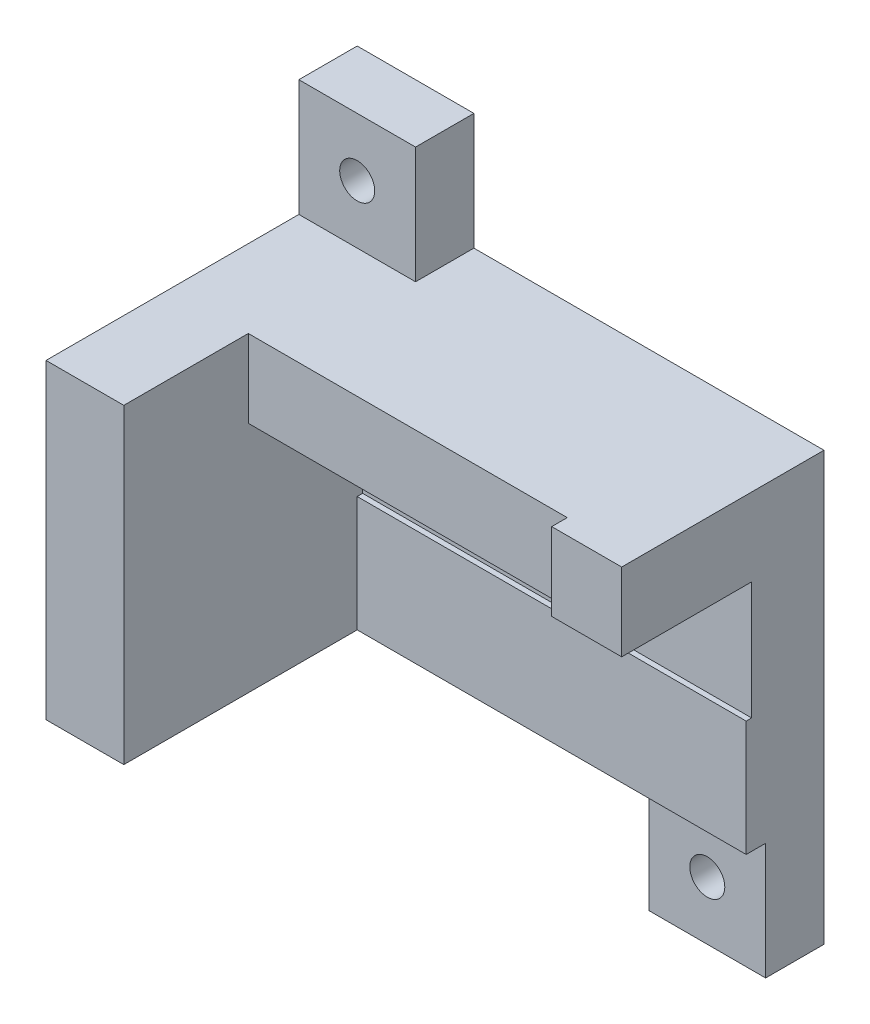
ISO-10303-21;
HEADER;
FILE_DESCRIPTION(('STEP AP214'),'2;1');
FILE_NAME('part.step','',(''),(''),'','','');
FILE_SCHEMA(('AUTOMOTIVE_DESIGN { 1 0 10303 214 1 1 1 1 }'));
ENDSEC;
DATA;
#1=APPLICATION_CONTEXT('core data for automotive mechanical design processes');
#2=APPLICATION_PROTOCOL_DEFINITION('international standard','automotive_design',2000,#1);
#3=PRODUCT_CONTEXT('',#1,'mechanical');
#4=PRODUCT('Part','Part','',(#3));
#5=PRODUCT_RELATED_PRODUCT_CATEGORY('part','',(#4));
#6=PRODUCT_DEFINITION_FORMATION('','',#4);
#7=PRODUCT_DEFINITION_CONTEXT('part definition',#1,'design');
#8=PRODUCT_DEFINITION('design','',#6,#7);
#9=PRODUCT_DEFINITION_SHAPE('','',#8);
#10=(LENGTH_UNIT() NAMED_UNIT(*) SI_UNIT(.MILLI.,.METRE.));
#11=(NAMED_UNIT(*) PLANE_ANGLE_UNIT() SI_UNIT($,.RADIAN.));
#12=(NAMED_UNIT(*) SI_UNIT($,.STERADIAN.) SOLID_ANGLE_UNIT());
#13=UNCERTAINTY_MEASURE_WITH_UNIT(LENGTH_MEASURE(1.E-05),#10,'distance_accuracy_value','');
#14=(GEOMETRIC_REPRESENTATION_CONTEXT(3) GLOBAL_UNCERTAINTY_ASSIGNED_CONTEXT((#13)) GLOBAL_UNIT_ASSIGNED_CONTEXT((#10,
#11,#12)) REPRESENTATION_CONTEXT('',''));
#15=CARTESIAN_POINT('',(0.,0.,0.));
#16=DIRECTION('',(0.,0.,1.));
#17=DIRECTION('',(1.,0.,0.));
#18=AXIS2_PLACEMENT_3D('',#15,#16,#17);
#19=CARTESIAN_POINT('',(0.,40.,40.));
#20=DIRECTION('',(0.,-1.,0.));
#21=DIRECTION('',(0.,0.,-1.));
#22=AXIS2_PLACEMENT_3D('',#19,#20,#21);
#23=PLANE('',#22);
#24=DIRECTION('',(1.,0.,0.));
#25=VECTOR('',#24,1.);
#26=CARTESIAN_POINT('',(0.,40.,7.5));
#27=LINE('',#26,#25);
#28=CARTESIAN_POINT('',(0.,40.,7.5));
#29=VERTEX_POINT('',#28);
#30=CARTESIAN_POINT('',(15.,40.,7.5));
#31=VERTEX_POINT('',#30);
#32=EDGE_CURVE('E59',#29,#31,#27,.T.);
#33=ORIENTED_EDGE('',*,*,#32,.F.);
#34=DIRECTION('',(0.,0.,-1.));
#35=VECTOR('',#34,1.);
#36=CARTESIAN_POINT('',(0.,40.,40.));
#37=LINE('',#36,#35);
#38=CARTESIAN_POINT('',(0.,40.,40.));
#39=VERTEX_POINT('',#38);
#40=EDGE_CURVE('E360',#39,#29,#37,.T.);
#41=ORIENTED_EDGE('',*,*,#40,.F.);
#42=DIRECTION('',(-1.,0.,0.));
#43=VECTOR('',#42,1.);
#44=CARTESIAN_POINT('',(0.,40.,40.));
#45=LINE('',#44,#43);
#46=CARTESIAN_POINT('',(10.,40.,40.));
#47=VERTEX_POINT('',#46);
#48=EDGE_CURVE('E337',#47,#39,#45,.T.);
#49=ORIENTED_EDGE('',*,*,#48,.F.);
#50=DIRECTION('',(0.,0.,1.));
#51=VECTOR('',#50,1.);
#52=CARTESIAN_POINT('',(10.,40.,26.));
#53=LINE('',#52,#51);
#54=CARTESIAN_POINT('',(10.,40.,24.));
#55=VERTEX_POINT('',#54);
#56=EDGE_CURVE('E277',#55,#47,#53,.T.);
#57=ORIENTED_EDGE('',*,*,#56,.F.);
#58=DIRECTION('',(-1.,0.,0.));
#59=VECTOR('',#58,1.);
#60=CARTESIAN_POINT('',(10.,40.,24.));
#61=LINE('',#60,#59);
#62=CARTESIAN_POINT('',(51.,40.,24.));
#63=VERTEX_POINT('',#62);
#64=EDGE_CURVE('E254',#63,#55,#61,.T.);
#65=ORIENTED_EDGE('',*,*,#64,.F.);
#66=DIRECTION('',(0.,0.,1.));
#67=VECTOR('',#66,1.);
#68=CARTESIAN_POINT('',(51.,40.,24.));
#69=LINE('',#68,#67);
#70=CARTESIAN_POINT('',(51.,40.,26.));
#71=VERTEX_POINT('',#70);
#72=EDGE_CURVE('E261',#63,#71,#69,.T.);
#73=ORIENTED_EDGE('',*,*,#72,.T.);
#74=DIRECTION('',(-1.,0.,0.));
#75=VECTOR('',#74,1.);
#76=CARTESIAN_POINT('',(10.,40.,26.));
#77=LINE('',#76,#75);
#78=CARTESIAN_POINT('',(60.,40.,26.));
#79=VERTEX_POINT('',#78);
#80=EDGE_CURVE('E273',#79,#71,#77,.T.);
#81=ORIENTED_EDGE('',*,*,#80,.F.);
#82=DIRECTION('',(0.,0.,-1.));
#83=VECTOR('',#82,1.);
#84=CARTESIAN_POINT('',(60.,40.,40.));
#85=LINE('',#84,#83);
#86=CARTESIAN_POINT('',(60.,40.,0.));
#87=VERTEX_POINT('',#86);
#88=EDGE_CURVE('E52',#79,#87,#85,.T.);
#89=ORIENTED_EDGE('',*,*,#88,.T.);
#90=DIRECTION('',(-1.,0.,0.));
#91=VECTOR('',#90,1.);
#92=CARTESIAN_POINT('',(0.,40.,0.));
#93=LINE('',#92,#91);
#94=CARTESIAN_POINT('',(15.,40.,0.));
#95=VERTEX_POINT('',#94);
#96=EDGE_CURVE('E351',#87,#95,#93,.T.);
#97=ORIENTED_EDGE('',*,*,#96,.T.);
#98=DIRECTION('',(0.,0.,1.));
#99=VECTOR('',#98,1.);
#100=CARTESIAN_POINT('',(15.,40.,0.));
#101=LINE('',#100,#99);
#102=EDGE_CURVE('E180',#95,#31,#101,.T.);
#103=ORIENTED_EDGE('',*,*,#102,.T.);
#104=EDGE_LOOP('',(#33,#41,#49,#57,#65,#73,#81,#89,#97,#103));
#105=FACE_BOUND('',#104,.T.);
#106=ADVANCED_FACE('F43',(#105),#23,.F.);
#107=CARTESIAN_POINT('',(60.,0.,40.));
#108=DIRECTION('',(0.,1.,0.));
#109=DIRECTION('',(-1.,0.,0.));
#110=AXIS2_PLACEMENT_3D('',#107,#108,#109);
#111=PLANE('',#110);
#112=DIRECTION('',(0.,0.,-1.));
#113=VECTOR('',#112,1.);
#114=CARTESIAN_POINT('',(45.,0.,0.));
#115=LINE('',#114,#113);
#116=CARTESIAN_POINT('',(45.,0.,7.5));
#117=VERTEX_POINT('',#116);
#118=CARTESIAN_POINT('',(45.,0.,0.));
#119=VERTEX_POINT('',#118);
#120=EDGE_CURVE('E215',#117,#119,#115,.T.);
#121=ORIENTED_EDGE('',*,*,#120,.F.);
#122=DIRECTION('',(-1.,0.,0.));
#123=VECTOR('',#122,1.);
#124=CARTESIAN_POINT('',(60.,0.,7.5));
#125=LINE('',#124,#123);
#126=CARTESIAN_POINT('',(60.,0.,7.5));
#127=VERTEX_POINT('',#126);
#128=EDGE_CURVE('E67',#127,#117,#125,.T.);
#129=ORIENTED_EDGE('',*,*,#128,.F.);
#130=DIRECTION('',(0.,0.,-1.));
#131=VECTOR('',#130,1.);
#132=CARTESIAN_POINT('',(60.,0.,40.));
#133=LINE('',#132,#131);
#134=CARTESIAN_POINT('',(60.,0.,10.));
#135=VERTEX_POINT('',#134);
#136=EDGE_CURVE('E11',#135,#127,#133,.T.);
#137=ORIENTED_EDGE('',*,*,#136,.F.);
#138=DIRECTION('',(1.,0.,0.));
#139=VECTOR('',#138,1.);
#140=CARTESIAN_POINT('',(10.,0.,10.));
#141=LINE('',#140,#139);
#142=CARTESIAN_POINT('',(10.,0.,10.));
#143=VERTEX_POINT('',#142);
#144=EDGE_CURVE('E308',#143,#135,#141,.T.);
#145=ORIENTED_EDGE('',*,*,#144,.F.);
#146=DIRECTION('',(0.,0.,1.));
#147=VECTOR('',#146,1.);
#148=CARTESIAN_POINT('',(10.,0.,10.));
#149=LINE('',#148,#147);
#150=CARTESIAN_POINT('',(10.,0.,40.));
#151=VERTEX_POINT('',#150);
#152=EDGE_CURVE('E321',#143,#151,#149,.T.);
#153=ORIENTED_EDGE('',*,*,#152,.T.);
#154=DIRECTION('',(1.,0.,0.));
#155=VECTOR('',#154,1.);
#156=CARTESIAN_POINT('',(60.,0.,40.));
#157=LINE('',#156,#155);
#158=CARTESIAN_POINT('',(0.,0.,40.));
#159=VERTEX_POINT('',#158);
#160=EDGE_CURVE('E333',#159,#151,#157,.T.);
#161=ORIENTED_EDGE('',*,*,#160,.F.);
#162=DIRECTION('',(0.,0.,-1.));
#163=VECTOR('',#162,1.);
#164=CARTESIAN_POINT('',(0.,0.,40.));
#165=LINE('',#164,#163);
#166=CARTESIAN_POINT('',(0.,0.,0.));
#167=VERTEX_POINT('',#166);
#168=EDGE_CURVE('E344',#159,#167,#165,.T.);
#169=ORIENTED_EDGE('',*,*,#168,.T.);
#170=DIRECTION('',(1.,0.,0.));
#171=VECTOR('',#170,1.);
#172=CARTESIAN_POINT('',(60.,0.,0.));
#173=LINE('',#172,#171);
#174=EDGE_CURVE('E325',#167,#119,#173,.T.);
#175=ORIENTED_EDGE('',*,*,#174,.T.);
#176=EDGE_LOOP('',(#121,#129,#137,#145,#153,#161,#169,#175));
#177=FACE_BOUND('',#176,.T.);
#178=ADVANCED_FACE('F45',(#177),#111,.F.);
#179=CARTESIAN_POINT('',(60.,40.,40.));
#180=DIRECTION('',(-1.,0.,0.));
#181=DIRECTION('',(0.,0.,1.));
#182=AXIS2_PLACEMENT_3D('',#179,#180,#181);
#183=PLANE('',#182);
#184=ORIENTED_EDGE('',*,*,#88,.F.);
#185=DIRECTION('',(0.,1.,0.));
#186=VECTOR('',#185,1.);
#187=CARTESIAN_POINT('',(60.,30.,26.));
#188=LINE('',#187,#186);
#189=CARTESIAN_POINT('',(60.,30.,26.));
#190=VERTEX_POINT('',#189);
#191=EDGE_CURVE('E270',#190,#79,#188,.T.);
#192=ORIENTED_EDGE('',*,*,#191,.F.);
#193=DIRECTION('',(0.,0.,1.));
#194=VECTOR('',#193,1.);
#195=CARTESIAN_POINT('',(60.,30.,10.));
#196=LINE('',#195,#194);
#197=CARTESIAN_POINT('',(60.,30.,9.3));
#198=VERTEX_POINT('',#197);
#199=EDGE_CURVE('E318',#198,#190,#196,.T.);
#200=ORIENTED_EDGE('',*,*,#199,.F.);
#201=DIRECTION('',(0.,1.,0.));
#202=VECTOR('',#201,1.);
#203=CARTESIAN_POINT('',(60.,30.,9.3));
#204=LINE('',#203,#202);
#205=CARTESIAN_POINT('',(60.,14.85,9.3));
#206=VERTEX_POINT('',#205);
#207=EDGE_CURVE('E290',#206,#198,#204,.T.);
#208=ORIENTED_EDGE('',*,*,#207,.F.);
#209=DIRECTION('',(0.,0.,1.));
#210=VECTOR('',#209,1.);
#211=CARTESIAN_POINT('',(60.,14.85,9.3));
#212=LINE('',#211,#210);
#213=CARTESIAN_POINT('',(60.,14.85,10.));
#214=VERTEX_POINT('',#213);
#215=EDGE_CURVE('E301',#206,#214,#212,.T.);
#216=ORIENTED_EDGE('',*,*,#215,.T.);
#217=DIRECTION('',(0.,-1.,0.));
#218=VECTOR('',#217,1.);
#219=CARTESIAN_POINT('',(60.,30.,10.));
#220=LINE('',#219,#218);
#221=EDGE_CURVE('E312',#214,#135,#220,.T.);
#222=ORIENTED_EDGE('',*,*,#221,.T.);
#223=ORIENTED_EDGE('',*,*,#136,.T.);
#224=DIRECTION('',(0.,1.,0.));
#225=VECTOR('',#224,1.);
#226=CARTESIAN_POINT('',(60.,-15.,7.5));
#227=LINE('',#226,#225);
#228=CARTESIAN_POINT('',(60.,-15.,7.5));
#229=VERTEX_POINT('',#228);
#230=EDGE_CURVE('E238',#229,#127,#227,.T.);
#231=ORIENTED_EDGE('',*,*,#230,.F.);
#232=DIRECTION('',(0.,0.,1.));
#233=VECTOR('',#232,1.);
#234=CARTESIAN_POINT('',(60.,-15.,0.));
#235=LINE('',#234,#233);
#236=CARTESIAN_POINT('',(60.,-15.,0.));
#237=VERTEX_POINT('',#236);
#238=EDGE_CURVE('E210',#237,#229,#235,.T.);
#239=ORIENTED_EDGE('',*,*,#238,.F.);
#240=DIRECTION('',(0.,1.,0.));
#241=VECTOR('',#240,1.);
#242=CARTESIAN_POINT('',(60.,40.,0.));
#243=LINE('',#242,#241);
#244=EDGE_CURVE('E347',#237,#87,#243,.T.);
#245=ORIENTED_EDGE('',*,*,#244,.T.);
#246=EDGE_LOOP('',(#184,#192,#200,#208,#216,#222,#223,#231,#239,#245));
#247=FACE_BOUND('',#246,.T.);
#248=ADVANCED_FACE('F371',(#247),#183,.F.);
#249=CARTESIAN_POINT('',(0.,0.,40.));
#250=DIRECTION('',(1.,0.,0.));
#251=DIRECTION('',(0.,0.,-1.));
#252=AXIS2_PLACEMENT_3D('',#249,#250,#251);
#253=PLANE('',#252);
#254=DIRECTION('',(0.,-1.,0.));
#255=VECTOR('',#254,1.);
#256=CARTESIAN_POINT('',(0.,0.,0.));
#257=LINE('',#256,#255);
#258=CARTESIAN_POINT('',(0.,55.,0.));
#259=VERTEX_POINT('',#258);
#260=EDGE_CURVE('E338',#259,#167,#257,.T.);
#261=ORIENTED_EDGE('',*,*,#260,.T.);
#262=ORIENTED_EDGE('',*,*,#168,.F.);
#263=DIRECTION('',(0.,-1.,0.));
#264=VECTOR('',#263,1.);
#265=CARTESIAN_POINT('',(0.,0.,40.));
#266=LINE('',#265,#264);
#267=EDGE_CURVE('E341',#39,#159,#266,.T.);
#268=ORIENTED_EDGE('',*,*,#267,.F.);
#269=ORIENTED_EDGE('',*,*,#40,.T.);
#270=DIRECTION('',(0.,-1.,0.));
#271=VECTOR('',#270,1.);
#272=CARTESIAN_POINT('',(0.,55.,7.5));
#273=LINE('',#272,#271);
#274=CARTESIAN_POINT('',(0.,55.,7.5));
#275=VERTEX_POINT('',#274);
#276=EDGE_CURVE('E200',#275,#29,#273,.T.);
#277=ORIENTED_EDGE('',*,*,#276,.F.);
#278=DIRECTION('',(0.,0.,1.));
#279=VECTOR('',#278,1.);
#280=CARTESIAN_POINT('',(0.,55.,0.));
#281=LINE('',#280,#279);
#282=EDGE_CURVE('E177',#259,#275,#281,.T.);
#283=ORIENTED_EDGE('',*,*,#282,.F.);
#284=EDGE_LOOP('',(#261,#262,#268,#269,#277,#283));
#285=FACE_BOUND('',#284,.T.);
#286=ADVANCED_FACE('F381',(#285),#253,.F.);
#287=CARTESIAN_POINT('',(0.,0.,40.));
#288=DIRECTION('',(0.,0.,-1.));
#289=DIRECTION('',(-1.,0.,0.));
#290=AXIS2_PLACEMENT_3D('',#287,#288,#289);
#291=PLANE('',#290);
#292=DIRECTION('',(0.,-1.,0.));
#293=VECTOR('',#292,1.);
#294=CARTESIAN_POINT('',(10.,30.,40.));
#295=LINE('',#294,#293);
#296=EDGE_CURVE('E305',#47,#151,#295,.T.);
#297=ORIENTED_EDGE('',*,*,#296,.F.);
#298=ORIENTED_EDGE('',*,*,#48,.T.);
#299=ORIENTED_EDGE('',*,*,#267,.T.);
#300=ORIENTED_EDGE('',*,*,#160,.T.);
#301=EDGE_LOOP('',(#297,#298,#299,#300));
#302=FACE_BOUND('',#301,.T.);
#303=ADVANCED_FACE('F385',(#302),#291,.F.);
#304=CARTESIAN_POINT('',(0.,0.,0.));
#305=DIRECTION('',(0.,0.,-1.));
#306=DIRECTION('',(-1.,0.,0.));
#307=AXIS2_PLACEMENT_3D('',#304,#305,#306);
#308=PLANE('',#307);
#309=CARTESIAN_POINT('',(52.5,-7.5,0.));
#310=DIRECTION('',(0.,0.,-1.));
#311=DIRECTION('',(-1.,0.,0.));
#312=AXIS2_PLACEMENT_3D('',#309,#310,#311);
#313=CIRCLE('',#312,2.25);
#314=CARTESIAN_POINT('',(50.25,-7.5,0.));
#315=VERTEX_POINT('',#314);
#316=EDGE_CURVE('E672',#315,#315,#313,.F.);
#317=ORIENTED_EDGE('',*,*,#316,.T.);
#318=EDGE_LOOP('',(#317));
#319=FACE_BOUND('',#318,.T.);
#320=CARTESIAN_POINT('',(7.5,47.5,0.));
#321=DIRECTION('',(0.,0.,-1.));
#322=DIRECTION('',(-1.,0.,0.));
#323=AXIS2_PLACEMENT_3D('',#320,#321,#322);
#324=CIRCLE('',#323,2.25);
#325=CARTESIAN_POINT('',(5.25,47.5,0.));
#326=VERTEX_POINT('',#325);
#327=EDGE_CURVE('E678',#326,#326,#324,.F.);
#328=ORIENTED_EDGE('',*,*,#327,.T.);
#329=EDGE_LOOP('',(#328));
#330=FACE_BOUND('',#329,.T.);
#331=ORIENTED_EDGE('',*,*,#174,.F.);
#332=ORIENTED_EDGE('',*,*,#260,.F.);
#333=DIRECTION('',(1.,0.,0.));
#334=VECTOR('',#333,1.);
#335=CARTESIAN_POINT('',(0.,55.,0.));
#336=LINE('',#335,#334);
#337=CARTESIAN_POINT('',(15.,55.,0.));
#338=VERTEX_POINT('',#337);
#339=EDGE_CURVE('E192',#259,#338,#336,.T.);
#340=ORIENTED_EDGE('',*,*,#339,.T.);
#341=DIRECTION('',(0.,-1.,0.));
#342=VECTOR('',#341,1.);
#343=CARTESIAN_POINT('',(15.,55.,0.));
#344=LINE('',#343,#342);
#345=EDGE_CURVE('E188',#338,#95,#344,.T.);
#346=ORIENTED_EDGE('',*,*,#345,.T.);
#347=ORIENTED_EDGE('',*,*,#96,.F.);
#348=ORIENTED_EDGE('',*,*,#244,.F.);
#349=DIRECTION('',(1.,0.,0.));
#350=VECTOR('',#349,1.);
#351=CARTESIAN_POINT('',(60.,-15.,0.));
#352=LINE('',#351,#350);
#353=CARTESIAN_POINT('',(45.,-15.,0.));
#354=VERTEX_POINT('',#353);
#355=EDGE_CURVE('E221',#354,#237,#352,.T.);
#356=ORIENTED_EDGE('',*,*,#355,.F.);
#357=DIRECTION('',(0.,1.,0.));
#358=VECTOR('',#357,1.);
#359=CARTESIAN_POINT('',(45.,-15.,0.));
#360=LINE('',#359,#358);
#361=EDGE_CURVE('E225',#354,#119,#360,.T.);
#362=ORIENTED_EDGE('',*,*,#361,.T.);
#363=EDGE_LOOP('',(#331,#332,#340,#346,#347,#348,#356,#362));
#364=FACE_BOUND('',#363,.T.);
#365=ADVANCED_FACE('F376',(#319,#330,#364),#308,.T.);
#366=CARTESIAN_POINT('',(10.,30.,10.));
#367=DIRECTION('',(-1.,0.,0.));
#368=DIRECTION('',(0.,0.,1.));
#369=AXIS2_PLACEMENT_3D('',#366,#367,#368);
#370=PLANE('',#369);
#371=ORIENTED_EDGE('',*,*,#296,.T.);
#372=ORIENTED_EDGE('',*,*,#152,.F.);
#373=DIRECTION('',(0.,-1.,0.));
#374=VECTOR('',#373,1.);
#375=CARTESIAN_POINT('',(10.,30.,10.));
#376=LINE('',#375,#374);
#377=CARTESIAN_POINT('',(10.,14.85,10.));
#378=VERTEX_POINT('',#377);
#379=EDGE_CURVE('E315',#378,#143,#376,.T.);
#380=ORIENTED_EDGE('',*,*,#379,.F.);
#381=DIRECTION('',(0.,0.,1.));
#382=VECTOR('',#381,1.);
#383=CARTESIAN_POINT('',(10.,14.85,9.3));
#384=LINE('',#383,#382);
#385=CARTESIAN_POINT('',(10.,14.85,9.3));
#386=VERTEX_POINT('',#385);
#387=EDGE_CURVE('E298',#386,#378,#384,.T.);
#388=ORIENTED_EDGE('',*,*,#387,.F.);
#389=DIRECTION('',(0.,-1.,0.));
#390=VECTOR('',#389,1.);
#391=CARTESIAN_POINT('',(10.,30.,9.3));
#392=LINE('',#391,#390);
#393=CARTESIAN_POINT('',(10.,30.,9.3));
#394=VERTEX_POINT('',#393);
#395=EDGE_CURVE('E282',#394,#386,#392,.T.);
#396=ORIENTED_EDGE('',*,*,#395,.F.);
#397=DIRECTION('',(0.,0.,1.));
#398=VECTOR('',#397,1.);
#399=CARTESIAN_POINT('',(10.,30.,10.));
#400=LINE('',#399,#398);
#401=CARTESIAN_POINT('',(10.,30.,24.));
#402=VERTEX_POINT('',#401);
#403=EDGE_CURVE('E326',#394,#402,#400,.T.);
#404=ORIENTED_EDGE('',*,*,#403,.T.);
#405=DIRECTION('',(0.,-1.,0.));
#406=VECTOR('',#405,1.);
#407=CARTESIAN_POINT('',(10.,40.,24.));
#408=LINE('',#407,#406);
#409=EDGE_CURVE('E243',#55,#402,#408,.T.);
#410=ORIENTED_EDGE('',*,*,#409,.F.);
#411=ORIENTED_EDGE('',*,*,#56,.T.);
#412=EDGE_LOOP('',(#371,#372,#380,#388,#396,#404,#410,#411));
#413=FACE_BOUND('',#412,.T.);
#414=ADVANCED_FACE('F389',(#413),#370,.F.);
#415=CARTESIAN_POINT('',(10.,30.,10.));
#416=DIRECTION('',(0.,-1.,0.));
#417=DIRECTION('',(0.,0.,-1.));
#418=AXIS2_PLACEMENT_3D('',#415,#416,#417);
#419=PLANE('',#418);
#420=DIRECTION('',(0.,0.,1.));
#421=VECTOR('',#420,1.);
#422=CARTESIAN_POINT('',(51.,30.,24.));
#423=LINE('',#422,#421);
#424=CARTESIAN_POINT('',(51.,30.,24.));
#425=VERTEX_POINT('',#424);
#426=CARTESIAN_POINT('',(51.,30.,26.));
#427=VERTEX_POINT('',#426);
#428=EDGE_CURVE('E258',#425,#427,#423,.T.);
#429=ORIENTED_EDGE('',*,*,#428,.F.);
#430=DIRECTION('',(1.,0.,0.));
#431=VECTOR('',#430,1.);
#432=CARTESIAN_POINT('',(10.,30.,24.));
#433=LINE('',#432,#431);
#434=EDGE_CURVE('E246',#402,#425,#433,.T.);
#435=ORIENTED_EDGE('',*,*,#434,.F.);
#436=ORIENTED_EDGE('',*,*,#403,.F.);
#437=DIRECTION('',(-1.,0.,0.));
#438=VECTOR('',#437,1.);
#439=CARTESIAN_POINT('',(10.,30.,9.3));
#440=LINE('',#439,#438);
#441=EDGE_CURVE('E294',#198,#394,#440,.T.);
#442=ORIENTED_EDGE('',*,*,#441,.F.);
#443=ORIENTED_EDGE('',*,*,#199,.T.);
#444=DIRECTION('',(1.,0.,0.));
#445=VECTOR('',#444,1.);
#446=CARTESIAN_POINT('',(10.,30.,26.));
#447=LINE('',#446,#445);
#448=EDGE_CURVE('E265',#427,#190,#447,.T.);
#449=ORIENTED_EDGE('',*,*,#448,.F.);
#450=EDGE_LOOP('',(#429,#435,#436,#442,#443,#449));
#451=FACE_BOUND('',#450,.T.);
#452=ADVANCED_FACE('F404',(#451),#419,.T.);
#453=CARTESIAN_POINT('',(0.,0.,10.));
#454=DIRECTION('',(0.,0.,-1.));
#455=DIRECTION('',(-1.,0.,0.));
#456=AXIS2_PLACEMENT_3D('',#453,#454,#455);
#457=PLANE('',#456);
#458=ORIENTED_EDGE('',*,*,#221,.F.);
#459=DIRECTION('',(1.,0.,0.));
#460=VECTOR('',#459,1.);
#461=CARTESIAN_POINT('',(10.,14.85,10.));
#462=LINE('',#461,#460);
#463=EDGE_CURVE('E281',#378,#214,#462,.T.);
#464=ORIENTED_EDGE('',*,*,#463,.F.);
#465=ORIENTED_EDGE('',*,*,#379,.T.);
#466=ORIENTED_EDGE('',*,*,#144,.T.);
#467=EDGE_LOOP('',(#458,#464,#465,#466));
#468=FACE_BOUND('',#467,.T.);
#469=ADVANCED_FACE('F412',(#468),#457,.F.);
#470=CARTESIAN_POINT('',(10.,14.85,9.3));
#471=DIRECTION('',(0.,-1.,0.));
#472=DIRECTION('',(0.,0.,-1.));
#473=AXIS2_PLACEMENT_3D('',#470,#471,#472);
#474=PLANE('',#473);
#475=ORIENTED_EDGE('',*,*,#463,.T.);
#476=ORIENTED_EDGE('',*,*,#215,.F.);
#477=DIRECTION('',(1.,0.,0.));
#478=VECTOR('',#477,1.);
#479=CARTESIAN_POINT('',(10.,14.85,9.3));
#480=LINE('',#479,#478);
#481=EDGE_CURVE('E286',#386,#206,#480,.T.);
#482=ORIENTED_EDGE('',*,*,#481,.F.);
#483=ORIENTED_EDGE('',*,*,#387,.T.);
#484=EDGE_LOOP('',(#475,#476,#482,#483));
#485=FACE_BOUND('',#484,.T.);
#486=ADVANCED_FACE('F425',(#485),#474,.F.);
#487=CARTESIAN_POINT('',(0.,0.,9.3));
#488=DIRECTION('',(0.,0.,1.));
#489=DIRECTION('',(1.,0.,0.));
#490=AXIS2_PLACEMENT_3D('',#487,#488,#489);
#491=PLANE('',#490);
#492=ORIENTED_EDGE('',*,*,#395,.T.);
#493=ORIENTED_EDGE('',*,*,#481,.T.);
#494=ORIENTED_EDGE('',*,*,#207,.T.);
#495=ORIENTED_EDGE('',*,*,#441,.T.);
#496=EDGE_LOOP('',(#492,#493,#494,#495));
#497=FACE_BOUND('',#496,.T.);
#498=ADVANCED_FACE('F406',(#497),#491,.T.);
#499=CARTESIAN_POINT('',(0.,0.,26.));
#500=DIRECTION('',(0.,0.,-1.));
#501=DIRECTION('',(-1.,0.,0.));
#502=AXIS2_PLACEMENT_3D('',#499,#500,#501);
#503=PLANE('',#502);
#504=ORIENTED_EDGE('',*,*,#80,.T.);
#505=DIRECTION('',(0.,1.,0.));
#506=VECTOR('',#505,1.);
#507=CARTESIAN_POINT('',(51.,40.,26.));
#508=LINE('',#507,#506);
#509=EDGE_CURVE('E242',#427,#71,#508,.T.);
#510=ORIENTED_EDGE('',*,*,#509,.F.);
#511=ORIENTED_EDGE('',*,*,#448,.T.);
#512=ORIENTED_EDGE('',*,*,#191,.T.);
#513=EDGE_LOOP('',(#504,#510,#511,#512));
#514=FACE_BOUND('',#513,.T.);
#515=ADVANCED_FACE('F399',(#514),#503,.F.);
#516=CARTESIAN_POINT('',(51.,40.,24.));
#517=DIRECTION('',(1.,0.,0.));
#518=DIRECTION('',(0.,0.,-1.));
#519=AXIS2_PLACEMENT_3D('',#516,#517,#518);
#520=PLANE('',#519);
#521=ORIENTED_EDGE('',*,*,#509,.T.);
#522=ORIENTED_EDGE('',*,*,#72,.F.);
#523=DIRECTION('',(0.,1.,0.));
#524=VECTOR('',#523,1.);
#525=CARTESIAN_POINT('',(51.,40.,24.));
#526=LINE('',#525,#524);
#527=EDGE_CURVE('E250',#425,#63,#526,.T.);
#528=ORIENTED_EDGE('',*,*,#527,.F.);
#529=ORIENTED_EDGE('',*,*,#428,.T.);
#530=EDGE_LOOP('',(#521,#522,#528,#529));
#531=FACE_BOUND('',#530,.T.);
#532=ADVANCED_FACE('F396',(#531),#520,.F.);
#533=CARTESIAN_POINT('',(0.,0.,24.));
#534=DIRECTION('',(0.,0.,1.));
#535=DIRECTION('',(1.,0.,0.));
#536=AXIS2_PLACEMENT_3D('',#533,#534,#535);
#537=PLANE('',#536);
#538=ORIENTED_EDGE('',*,*,#409,.T.);
#539=ORIENTED_EDGE('',*,*,#434,.T.);
#540=ORIENTED_EDGE('',*,*,#527,.T.);
#541=ORIENTED_EDGE('',*,*,#64,.T.);
#542=EDGE_LOOP('',(#538,#539,#540,#541));
#543=FACE_BOUND('',#542,.T.);
#544=ADVANCED_FACE('F393',(#543),#537,.T.);
#545=CARTESIAN_POINT('',(60.,-15.,7.5));
#546=DIRECTION('',(0.,0.,-1.));
#547=DIRECTION('',(-1.,0.,0.));
#548=AXIS2_PLACEMENT_3D('',#545,#546,#547);
#549=PLANE('',#548);
#550=CARTESIAN_POINT('',(52.5,-7.5,7.49999999999999));
#551=DIRECTION('',(0.,0.,1.));
#552=DIRECTION('',(1.,0.,0.));
#553=AXIS2_PLACEMENT_3D('',#550,#551,#552);
#554=CIRCLE('',#553,2.25);
#555=CARTESIAN_POINT('',(54.75,-7.5,7.49999999999999));
#556=VERTEX_POINT('',#555);
#557=EDGE_CURVE('E203',#556,#556,#554,.T.);
#558=ORIENTED_EDGE('',*,*,#557,.F.);
#559=EDGE_LOOP('',(#558));
#560=FACE_BOUND('',#559,.T.);
#561=ORIENTED_EDGE('',*,*,#128,.T.);
#562=DIRECTION('',(0.,1.,0.));
#563=VECTOR('',#562,1.);
#564=CARTESIAN_POINT('',(45.,-15.,7.5));
#565=LINE('',#564,#563);
#566=CARTESIAN_POINT('',(45.,-15.,7.5));
#567=VERTEX_POINT('',#566);
#568=EDGE_CURVE('E234',#567,#117,#565,.T.);
#569=ORIENTED_EDGE('',*,*,#568,.F.);
#570=DIRECTION('',(-1.,0.,0.));
#571=VECTOR('',#570,1.);
#572=CARTESIAN_POINT('',(60.,-15.,7.5));
#573=LINE('',#572,#571);
#574=EDGE_CURVE('E214',#229,#567,#573,.T.);
#575=ORIENTED_EDGE('',*,*,#574,.F.);
#576=ORIENTED_EDGE('',*,*,#230,.T.);
#577=EDGE_LOOP('',(#561,#569,#575,#576));
#578=FACE_BOUND('',#577,.T.);
#579=ADVANCED_FACE('F417',(#560,#578),#549,.F.);
#580=CARTESIAN_POINT('',(45.,-15.,0.));
#581=DIRECTION('',(1.,0.,0.));
#582=DIRECTION('',(0.,1.,0.));
#583=AXIS2_PLACEMENT_3D('',#580,#581,#582);
#584=PLANE('',#583);
#585=ORIENTED_EDGE('',*,*,#120,.T.);
#586=ORIENTED_EDGE('',*,*,#361,.F.);
#587=DIRECTION('',(0.,0.,-1.));
#588=VECTOR('',#587,1.);
#589=CARTESIAN_POINT('',(45.,-15.,0.));
#590=LINE('',#589,#588);
#591=EDGE_CURVE('E218',#567,#354,#590,.T.);
#592=ORIENTED_EDGE('',*,*,#591,.F.);
#593=ORIENTED_EDGE('',*,*,#568,.T.);
#594=EDGE_LOOP('',(#585,#586,#592,#593));
#595=FACE_BOUND('',#594,.T.);
#596=ADVANCED_FACE('F424',(#595),#584,.F.);
#597=CARTESIAN_POINT('',(0.,-15.,0.));
#598=DIRECTION('',(0.,-1.,0.));
#599=DIRECTION('',(1.,0.,0.));
#600=AXIS2_PLACEMENT_3D('',#597,#598,#599);
#601=PLANE('',#600);
#602=ORIENTED_EDGE('',*,*,#238,.T.);
#603=ORIENTED_EDGE('',*,*,#574,.T.);
#604=ORIENTED_EDGE('',*,*,#591,.T.);
#605=ORIENTED_EDGE('',*,*,#355,.T.);
#606=EDGE_LOOP('',(#602,#603,#604,#605));
#607=FACE_BOUND('',#606,.T.);
#608=ADVANCED_FACE('F421',(#607),#601,.T.);
#609=CARTESIAN_POINT('',(0.,55.,7.5));
#610=DIRECTION('',(0.,0.,-1.));
#611=DIRECTION('',(-1.,0.,0.));
#612=AXIS2_PLACEMENT_3D('',#609,#610,#611);
#613=PLANE('',#612);
#614=CARTESIAN_POINT('',(7.5,47.5,7.49999999999999));
#615=DIRECTION('',(0.,0.,1.));
#616=DIRECTION('',(1.,0.,0.));
#617=AXIS2_PLACEMENT_3D('',#614,#615,#616);
#618=CIRCLE('',#617,2.25);
#619=CARTESIAN_POINT('',(9.75,47.5,7.49999999999999));
#620=VERTEX_POINT('',#619);
#621=EDGE_CURVE('E683',#620,#620,#618,.T.);
#622=ORIENTED_EDGE('',*,*,#621,.F.);
#623=EDGE_LOOP('',(#622));
#624=FACE_BOUND('',#623,.T.);
#625=ORIENTED_EDGE('',*,*,#32,.T.);
#626=DIRECTION('',(0.,-1.,0.));
#627=VECTOR('',#626,1.);
#628=CARTESIAN_POINT('',(15.,55.,7.5));
#629=LINE('',#628,#627);
#630=CARTESIAN_POINT('',(15.,55.,7.5));
#631=VERTEX_POINT('',#630);
#632=EDGE_CURVE('E182',#631,#31,#629,.T.);
#633=ORIENTED_EDGE('',*,*,#632,.F.);
#634=DIRECTION('',(1.,0.,0.));
#635=VECTOR('',#634,1.);
#636=CARTESIAN_POINT('',(0.,55.,7.5));
#637=LINE('',#636,#635);
#638=EDGE_CURVE('E170',#275,#631,#637,.T.);
#639=ORIENTED_EDGE('',*,*,#638,.F.);
#640=ORIENTED_EDGE('',*,*,#276,.T.);
#641=EDGE_LOOP('',(#625,#633,#639,#640));
#642=FACE_BOUND('',#641,.T.);
#643=ADVANCED_FACE('F183',(#624,#642),#613,.F.);
#644=CARTESIAN_POINT('',(15.,55.,0.));
#645=DIRECTION('',(1.,0.,0.));
#646=DIRECTION('',(0.,0.,-1.));
#647=AXIS2_PLACEMENT_3D('',#644,#645,#646);
#648=PLANE('',#647);
#649=ORIENTED_EDGE('',*,*,#102,.F.);
#650=ORIENTED_EDGE('',*,*,#345,.F.);
#651=DIRECTION('',(0.,0.,1.));
#652=VECTOR('',#651,1.);
#653=CARTESIAN_POINT('',(15.,55.,0.));
#654=LINE('',#653,#652);
#655=EDGE_CURVE('E174',#338,#631,#654,.T.);
#656=ORIENTED_EDGE('',*,*,#655,.T.);
#657=ORIENTED_EDGE('',*,*,#632,.T.);
#658=EDGE_LOOP('',(#649,#650,#656,#657));
#659=FACE_BOUND('',#658,.T.);
#660=ADVANCED_FACE('F190',(#659),#648,.T.);
#661=CARTESIAN_POINT('',(0.,55.,0.));
#662=DIRECTION('',(0.,-1.,0.));
#663=DIRECTION('',(0.,0.,-1.));
#664=AXIS2_PLACEMENT_3D('',#661,#662,#663);
#665=PLANE('',#664);
#666=ORIENTED_EDGE('',*,*,#638,.T.);
#667=ORIENTED_EDGE('',*,*,#655,.F.);
#668=ORIENTED_EDGE('',*,*,#339,.F.);
#669=ORIENTED_EDGE('',*,*,#282,.T.);
#670=EDGE_LOOP('',(#666,#667,#668,#669));
#671=FACE_BOUND('',#670,.T.);
#672=ADVANCED_FACE('F171',(#671),#665,.F.);
#673=CARTESIAN_POINT('',(7.5,47.5,-0.00100000000000187));
#674=DIRECTION('',(0.,0.,1.));
#675=DIRECTION('',(1.,0.,0.));
#676=AXIS2_PLACEMENT_3D('',#673,#674,#675);
#677=CYLINDRICAL_SURFACE('',#676,2.25);
#678=ORIENTED_EDGE('',*,*,#327,.F.);
#679=EDGE_LOOP('',(#678));
#680=FACE_BOUND('',#679,.T.);
#681=ORIENTED_EDGE('',*,*,#621,.T.);
#682=EDGE_LOOP('',(#681));
#683=FACE_BOUND('',#682,.T.);
#684=ADVANCED_FACE('F615',(#680,#683),#677,.F.);
#685=CARTESIAN_POINT('',(52.5,-7.5,-0.00100000000000187));
#686=DIRECTION('',(0.,0.,1.));
#687=DIRECTION('',(1.,0.,0.));
#688=AXIS2_PLACEMENT_3D('',#685,#686,#687);
#689=CYLINDRICAL_SURFACE('',#688,2.25);
#690=ORIENTED_EDGE('',*,*,#316,.F.);
#691=EDGE_LOOP('',(#690));
#692=FACE_BOUND('',#691,.T.);
#693=ORIENTED_EDGE('',*,*,#557,.T.);
#694=EDGE_LOOP('',(#693));
#695=FACE_BOUND('',#694,.T.);
#696=ADVANCED_FACE('F624',(#692,#695),#689,.F.);
#697=CLOSED_SHELL('',(#106,#178,#248,#286,#303,#365,#414,#452,#469,#486,#498,#515,#532,#544,
#579,#596,#608,#643,#660,#672,#684,#696));
#698=MANIFOLD_SOLID_BREP('B2',#697);
#699=ADVANCED_BREP_SHAPE_REPRESENTATION('',(#18,#698),#14);
#700=SHAPE_DEFINITION_REPRESENTATION(#9,#699);
ENDSEC;
END-ISO-10303-21;
